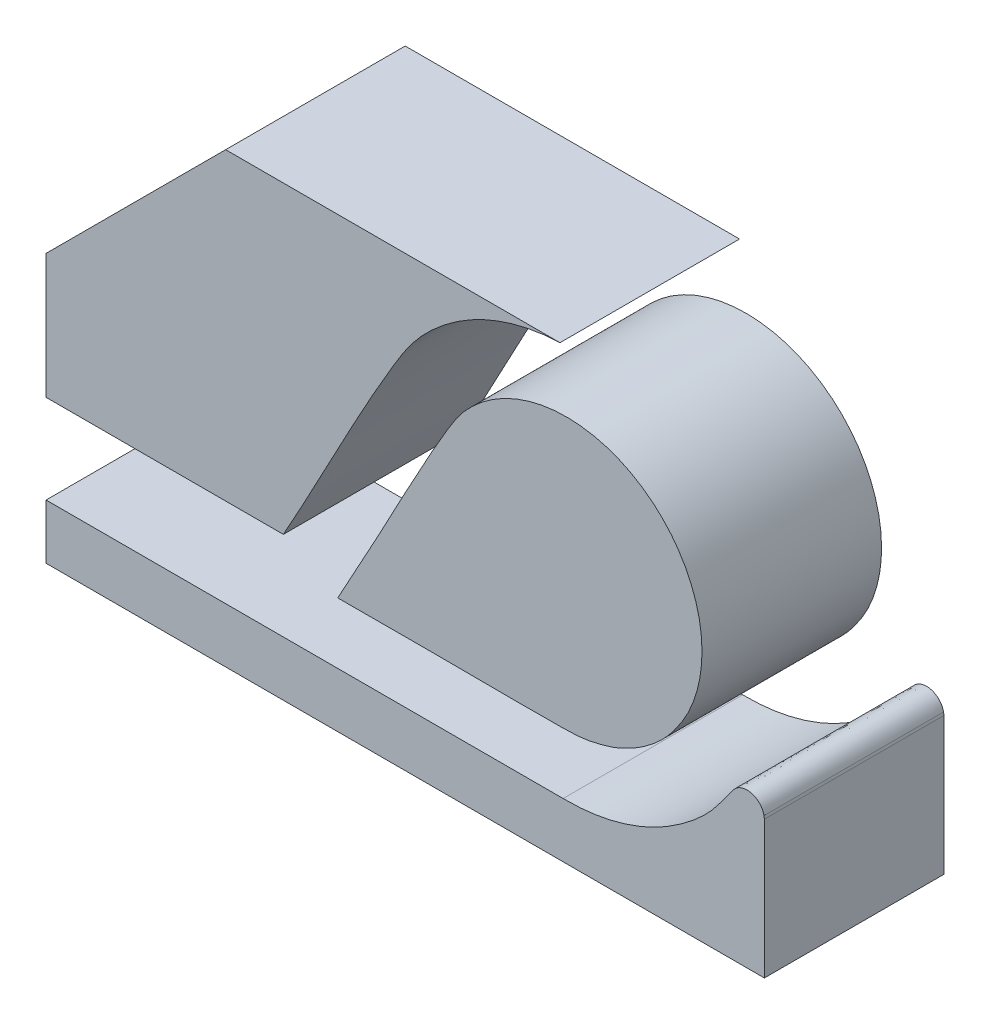
ISO-10303-21;
HEADER;
FILE_DESCRIPTION(('STEP AP214'),'2;1');
FILE_NAME('part.step','',(''),(''),'','','');
FILE_SCHEMA(('AUTOMOTIVE_DESIGN { 1 0 10303 214 1 1 1 1 }'));
ENDSEC;
DATA;
#1=APPLICATION_CONTEXT('core data for automotive mechanical design processes');
#2=APPLICATION_PROTOCOL_DEFINITION('international standard','automotive_design',2000,#1);
#3=PRODUCT_CONTEXT('',#1,'mechanical');
#4=PRODUCT('Part','Part','',(#3));
#5=PRODUCT_RELATED_PRODUCT_CATEGORY('part','',(#4));
#6=PRODUCT_DEFINITION_FORMATION('','',#4);
#7=PRODUCT_DEFINITION_CONTEXT('part definition',#1,'design');
#8=PRODUCT_DEFINITION('design','',#6,#7);
#9=PRODUCT_DEFINITION_SHAPE('','',#8);
#10=(LENGTH_UNIT() NAMED_UNIT(*) SI_UNIT(.MILLI.,.METRE.));
#11=(NAMED_UNIT(*) PLANE_ANGLE_UNIT() SI_UNIT($,.RADIAN.));
#12=(NAMED_UNIT(*) SI_UNIT($,.STERADIAN.) SOLID_ANGLE_UNIT());
#13=UNCERTAINTY_MEASURE_WITH_UNIT(LENGTH_MEASURE(1.E-05),#10,'distance_accuracy_value','');
#14=(GEOMETRIC_REPRESENTATION_CONTEXT(3) GLOBAL_UNCERTAINTY_ASSIGNED_CONTEXT((#13)) GLOBAL_UNIT_ASSIGNED_CONTEXT((#10,
#11,#12)) REPRESENTATION_CONTEXT('',''));
#15=CARTESIAN_POINT('',(0.,0.,0.));
#16=DIRECTION('',(0.,0.,1.));
#17=DIRECTION('',(1.,0.,0.));
#18=AXIS2_PLACEMENT_3D('',#15,#16,#17);
#19=CARTESIAN_POINT('',(-73.3949556313979,16.410378963894,5.));
#20=CARTESIAN_POINT('',(-73.0277419114467,17.0757318854613,5.));
#21=CARTESIAN_POINT('',(-72.0065935849801,18.925946039928,5.));
#22=CARTESIAN_POINT('',(-70.9490701940309,20.9951779777811,5.));
#23=CARTESIAN_POINT('',(-70.0234130863674,22.5185832279498,5.));
#24=CARTESIAN_POINT('',(-69.5841679400392,22.9858484151686,5.));
#25=CARTESIAN_POINT('',(-69.0781317832908,23.3766383034874,5.));
#26=CARTESIAN_POINT('',(-68.5121220467428,23.6757154495549,5.));
#27=CARTESIAN_POINT('',(-67.9042843139605,23.875664619468,5.));
#28=CARTESIAN_POINT('',(-67.2713762247597,23.9705076965152,5.));
#29=CARTESIAN_POINT('',(-66.6315595511487,23.95761371341,5.));
#30=CARTESIAN_POINT('',(-66.0030093475002,23.837333703275,5.));
#31=CARTESIAN_POINT('',(-65.4036298831868,23.6130967150452,5.));
#32=CARTESIAN_POINT('',(-64.8504774267978,23.2912869739816,5.));
#33=CARTESIAN_POINT('',(-64.3593022343778,22.8810595595448,5.));
#34=CARTESIAN_POINT('',(-63.9440844116064,22.3940973360927,5.));
#35=CARTESIAN_POINT('',(-63.6166416873118,21.8442578090215,5.));
#36=CARTESIAN_POINT('',(-63.3863080003475,21.2472022642012,5.));
#37=CARTESIAN_POINT('',(-63.2595832540932,20.6198964949968,5.));
#38=CARTESIAN_POINT('',(-63.240299322011,19.9803057131815,5.));
#39=CARTESIAN_POINT('',(-63.3281539326554,19.3462391542597,5.));
#40=CARTESIAN_POINT('',(-63.4963151713191,18.822873266533,5.));
#41=CARTESIAN_POINT('',(-63.6555595947336,18.4769507414638,5.));
#42=CARTESIAN_POINT('',(-63.8702227432938,18.110681823472,5.));
#43=CARTESIAN_POINT('',(-64.1658955906539,17.6857727130199,5.));
#44=CARTESIAN_POINT('',(-64.5888908803924,17.2904659312179,5.));
#45=CARTESIAN_POINT('',(-64.932267573991,17.0398858035983,5.));
#46=CARTESIAN_POINT('',(-65.2050822107201,16.8741184334112,5.));
#47=CARTESIAN_POINT('',(-65.4911624701182,16.733090750357,5.));
#48=CARTESIAN_POINT('',(-65.737595601697,16.6324477160917,5.));
#49=CARTESIAN_POINT('',(-65.9925806819812,16.5579282620137,5.));
#50=CARTESIAN_POINT('',(-66.1984061393678,16.5053516453406,5.));
#51=CARTESIAN_POINT('',(-66.4579346607578,16.4488192828729,5.));
#52=CARTESIAN_POINT('',(-66.7224498991614,16.4178111579424,5.));
#53=CARTESIAN_POINT('',(-67.735945429151,16.3926283074925,5.));
#54=CARTESIAN_POINT('',(-69.73973537417,16.4213086385378,5.));
#55=CARTESIAN_POINT('',(-71.7805744979587,16.4100735918947,5.));
#56=CARTESIAN_POINT('',(-73.0203742260045,16.4103473032519,5.));
#57=CARTESIAN_POINT('',(-73.1637838960396,16.410378963894,5.));
#58=B_SPLINE_CURVE_WITH_KNOTS('',3,(#19,#20,#21,#22,#23,#24,#25,#26,#27,#28,#29,#30,#31,#32,#33,
#34,#35,#36,#37,#38,#39,#40,#41,#42,#43,#44,#45,#46,#47,#48,#49,#50,#51,#52,#53,#54,#55,#56,
#57),.UNSPECIFIED.,.F.,.F.,(4,1,1,1,1,1,1,1,1,1,1,1,1,1,1,1,1,1,1,1,1,1,1,1,1,1,1,1,1,1,1,1,1,1,
1,1,4),(0.,0.080304634312455,0.223311217637975,0.24574875076157,0.268186211521939,
0.290623796229975,0.313061260343096,0.335498750343381,0.35793620920626,0.38037382737991,
0.402811343576478,0.425248837557594,0.447686333347444,0.470123867056318,0.492561383906202,
0.51499885677545,0.537436397125423,0.559873935635961,0.582311431887422,0.604748903367135,
0.62718643886649,0.640157588757618,0.644900538775652,0.672052802029292,0.694490331272225,
0.705719061569508,0.716947813367087,0.728176600015994,0.739405358547793,0.745019744338924,
0.756238516673911,0.761852913849765,0.77308165234301,0.78431043715441,0.868971771734146,
0.984843749715517,1.),.UNSPECIFIED.);
#59=DIRECTION('',(0.,0.,-1.));
#60=VECTOR('',#59,1.);
#61=SURFACE_OF_LINEAR_EXTRUSION('',#58,#60);
#62=CARTESIAN_POINT('',(-73.3949556313979,16.410378963894,0.));
#63=CARTESIAN_POINT('',(-73.0277419114467,17.0757318854613,0.));
#64=CARTESIAN_POINT('',(-72.0065935849801,18.925946039928,0.));
#65=CARTESIAN_POINT('',(-70.9490701940309,20.9951779777811,0.));
#66=CARTESIAN_POINT('',(-70.0234130863674,22.5185832279498,0.));
#67=CARTESIAN_POINT('',(-69.5841679400392,22.9858484151686,0.));
#68=CARTESIAN_POINT('',(-69.0781317832908,23.3766383034874,0.));
#69=CARTESIAN_POINT('',(-68.5121220467428,23.6757154495549,0.));
#70=CARTESIAN_POINT('',(-67.9042843139605,23.875664619468,0.));
#71=CARTESIAN_POINT('',(-67.2713762247597,23.9705076965152,0.));
#72=CARTESIAN_POINT('',(-66.6315595511487,23.95761371341,0.));
#73=CARTESIAN_POINT('',(-66.0030093475002,23.837333703275,0.));
#74=CARTESIAN_POINT('',(-65.4036298831868,23.6130967150452,0.));
#75=CARTESIAN_POINT('',(-64.8504774267978,23.2912869739816,0.));
#76=CARTESIAN_POINT('',(-64.3593022343778,22.8810595595448,0.));
#77=CARTESIAN_POINT('',(-63.9440844116064,22.3940973360927,0.));
#78=CARTESIAN_POINT('',(-63.6166416873118,21.8442578090215,0.));
#79=CARTESIAN_POINT('',(-63.3863080003475,21.2472022642012,0.));
#80=CARTESIAN_POINT('',(-63.2595832540932,20.6198964949968,0.));
#81=CARTESIAN_POINT('',(-63.240299322011,19.9803057131815,0.));
#82=CARTESIAN_POINT('',(-63.3281539326554,19.3462391542597,0.));
#83=CARTESIAN_POINT('',(-63.4963151713191,18.822873266533,0.));
#84=CARTESIAN_POINT('',(-63.6555595947336,18.4769507414638,0.));
#85=CARTESIAN_POINT('',(-63.8702227432938,18.110681823472,0.));
#86=CARTESIAN_POINT('',(-64.1658955906539,17.6857727130199,0.));
#87=CARTESIAN_POINT('',(-64.5888908803924,17.2904659312179,0.));
#88=CARTESIAN_POINT('',(-64.932267573991,17.0398858035983,0.));
#89=CARTESIAN_POINT('',(-65.2050822107201,16.8741184334112,0.));
#90=CARTESIAN_POINT('',(-65.4911624701182,16.733090750357,0.));
#91=CARTESIAN_POINT('',(-65.737595601697,16.6324477160917,0.));
#92=CARTESIAN_POINT('',(-65.9925806819812,16.5579282620137,0.));
#93=CARTESIAN_POINT('',(-66.1984061393678,16.5053516453406,0.));
#94=CARTESIAN_POINT('',(-66.4579346607578,16.4488192828729,0.));
#95=CARTESIAN_POINT('',(-66.7224498991614,16.4178111579424,0.));
#96=CARTESIAN_POINT('',(-67.735945429151,16.3926283074925,0.));
#97=CARTESIAN_POINT('',(-69.73973537417,16.4213086385378,0.));
#98=CARTESIAN_POINT('',(-71.7805744979587,16.4100735918947,0.));
#99=CARTESIAN_POINT('',(-73.0203742260045,16.4103473032519,0.));
#100=CARTESIAN_POINT('',(-73.1637838960396,16.410378963894,0.));
#101=B_SPLINE_CURVE_WITH_KNOTS('',3,(#62,#63,#64,#65,#66,#67,#68,#69,#70,#71,#72,#73,#74,#75,
#76,#77,#78,#79,#80,#81,#82,#83,#84,#85,#86,#87,#88,#89,#90,#91,#92,#93,#94,#95,#96,#97,#98,#99,
#100),.UNSPECIFIED.,.F.,.F.,(4,1,1,1,1,1,1,1,1,1,1,1,1,1,1,1,1,1,1,1,1,1,1,1,1,1,1,1,1,1,1,1,1,
1,1,1,4),(0.,0.080304634312455,0.223311217637975,0.24574875076157,0.268186211521939,
0.290623796229975,0.313061260343096,0.335498750343381,0.35793620920626,0.38037382737991,
0.402811343576478,0.425248837557594,0.447686333347444,0.470123867056318,0.492561383906202,
0.51499885677545,0.537436397125423,0.559873935635961,0.582311431887422,0.604748903367135,
0.62718643886649,0.640157588757618,0.644900538775652,0.672052802029292,0.694490331272225,
0.705719061569508,0.716947813367087,0.728176600015994,0.739405358547793,0.745019744338924,
0.756238516673911,0.761852913849765,0.77308165234301,0.78431043715441,0.868971771734146,
0.984843749715517,1.),.UNSPECIFIED.);
#102=CARTESIAN_POINT('',(-73.3949556313979,16.410378963894,0.));
#103=VERTEX_POINT('',#102);
#104=CARTESIAN_POINT('',(-73.1637838960396,16.410378963894,0.));
#105=VERTEX_POINT('',#104);
#106=EDGE_CURVE('E183',#103,#105,#101,.T.);
#107=ORIENTED_EDGE('',*,*,#106,.F.);
#108=DIRECTION('',(0.,0.,-1.));
#109=VECTOR('',#108,1.);
#110=CARTESIAN_POINT('',(-73.3949556313979,16.410378963894,5.));
#111=LINE('',#110,#109);
#112=CARTESIAN_POINT('',(-73.3949556313979,16.410378963894,5.));
#113=VERTEX_POINT('',#112);
#114=EDGE_CURVE('E13',#113,#103,#111,.T.);
#115=ORIENTED_EDGE('',*,*,#114,.F.);
#116=CARTESIAN_POINT('',(-73.1637838960396,16.410378963894,5.));
#117=VERTEX_POINT('',#116);
#118=EDGE_CURVE('E184',#113,#117,#58,.T.);
#119=ORIENTED_EDGE('',*,*,#118,.T.);
#120=DIRECTION('',(0.,0.,-1.));
#121=VECTOR('',#120,1.);
#122=CARTESIAN_POINT('',(-73.1637838960396,16.410378963894,5.));
#123=LINE('',#122,#121);
#124=EDGE_CURVE('E163',#117,#105,#123,.T.);
#125=ORIENTED_EDGE('',*,*,#124,.T.);
#126=EDGE_LOOP('',(#107,#115,#119,#125));
#127=FACE_BOUND('',#126,.T.);
#128=ADVANCED_FACE('F154',(#127),#61,.T.);
#129=CARTESIAN_POINT('',(0.,16.410378963894,5.));
#130=DIRECTION('',(0.,1.,0.));
#131=DIRECTION('',(0.,0.,1.));
#132=AXIS2_PLACEMENT_3D('',#129,#130,#131);
#133=PLANE('',#132);
#134=DIRECTION('',(1.,0.,0.));
#135=VECTOR('',#134,1.);
#136=CARTESIAN_POINT('',(0.,16.410378963894,0.));
#137=LINE('',#136,#135);
#138=EDGE_CURVE('E185',#103,#105,#137,.T.);
#139=ORIENTED_EDGE('',*,*,#138,.T.);
#140=ORIENTED_EDGE('',*,*,#124,.F.);
#141=DIRECTION('',(1.,0.,0.));
#142=VECTOR('',#141,1.);
#143=CARTESIAN_POINT('',(0.,16.410378963894,5.));
#144=LINE('',#143,#142);
#145=EDGE_CURVE('E170',#113,#117,#144,.T.);
#146=ORIENTED_EDGE('',*,*,#145,.F.);
#147=ORIENTED_EDGE('',*,*,#114,.T.);
#148=EDGE_LOOP('',(#139,#140,#146,#147));
#149=FACE_BOUND('',#148,.T.);
#150=ADVANCED_FACE('F186',(#149),#133,.F.);
#151=CARTESIAN_POINT('',(0.,0.,5.));
#152=DIRECTION('',(0.,0.,1.));
#153=DIRECTION('',(1.,0.,0.));
#154=AXIS2_PLACEMENT_3D('',#151,#152,#153);
#155=PLANE('',#154);
#156=ORIENTED_EDGE('',*,*,#118,.F.);
#157=ORIENTED_EDGE('',*,*,#145,.T.);
#158=EDGE_LOOP('',(#156,#157));
#159=FACE_BOUND('',#158,.T.);
#160=ADVANCED_FACE('F204',(#159),#155,.T.);
#161=CARTESIAN_POINT('',(0.,0.,0.));
#162=DIRECTION('',(0.,0.,1.));
#163=DIRECTION('',(1.,0.,0.));
#164=AXIS2_PLACEMENT_3D('',#161,#162,#163);
#165=PLANE('',#164);
#166=ORIENTED_EDGE('',*,*,#106,.T.);
#167=ORIENTED_EDGE('',*,*,#138,.F.);
#168=EDGE_LOOP('',(#166,#167));
#169=FACE_BOUND('',#168,.T.);
#170=ADVANCED_FACE('F189',(#169),#165,.F.);
#171=CLOSED_SHELL('',(#128,#150,#160,#170));
#172=MANIFOLD_SOLID_BREP('B2',#171);
#173=CARTESIAN_POINT('',(-67.1197841588077,14.7103781264487,5.));
#174=CARTESIAN_POINT('',(-67.0935582727583,14.7102319716835,5.));
#175=CARTESIAN_POINT('',(-66.7570566974385,14.7101815464652,5.));
#176=CARTESIAN_POINT('',(-66.1180095334015,14.7588945634733,5.));
#177=CARTESIAN_POINT('',(-65.2199205015816,14.9903824771147,5.));
#178=CARTESIAN_POINT('',(-64.5108099227769,15.3040428583451,5.));
#179=CARTESIAN_POINT('',(-63.991676041918,15.6249691899164,5.));
#180=CARTESIAN_POINT('',(-63.4872165289154,15.9880850617171,5.));
#181=CARTESIAN_POINT('',(-62.9165327240656,16.510148843801,5.));
#182=CARTESIAN_POINT('',(-62.565024786149,17.0505172792495,5.));
#183=CARTESIAN_POINT('',(-62.3423326323971,17.3353490876502,5.));
#184=CARTESIAN_POINT('',(-62.2809848936338,17.3871351316683,5.));
#185=CARTESIAN_POINT('',(-62.2125810070607,17.4286842174469,5.));
#186=CARTESIAN_POINT('',(-62.1380837345273,17.4582133037352,5.));
#187=CARTESIAN_POINT('',(-62.0597834049141,17.4750950936617,5.));
#188=CARTESIAN_POINT('',(-61.9797578865785,17.478809868195,5.));
#189=CARTESIAN_POINT('',(-61.9002192850942,17.46927582821,5.));
#190=CARTESIAN_POINT('',(-61.8233449156038,17.4467446622618,5.));
#191=CARTESIAN_POINT('',(-61.7512341408782,17.4118465196535,5.));
#192=CARTESIAN_POINT('',(-61.6858896229193,17.3655180457804,5.));
#193=CARTESIAN_POINT('',(-61.629025833112,17.309058933585,5.));
#194=CARTESIAN_POINT('',(-61.5824618727563,17.2439501751695,5.));
#195=CARTESIAN_POINT('',(-61.5465173340048,17.1721997553296,5.));
#196=CARTESIAN_POINT('',(-61.5326713839836,17.1206976809159,5.));
#197=CARTESIAN_POINT('',(-61.5261509381759,17.094897330946,5.));
#198=B_SPLINE_CURVE_WITH_KNOTS('',3,(#173,#174,#175,#176,#177,#178,#179,#180,#181,#182,#183,
#184,#185,#186,#187,#188,#189,#190,#191,#192,#193,#194,#195,#196,#197),.UNSPECIFIED.,.F.,.F.,(4,
1,1,1,1,1,1,1,1,1,1,1,1,1,1,1,1,1,1,1,1,1,4),(0.429055887917548,0.433439487481544,
0.485344665051265,0.537249839379783,0.589155040979122,0.615107635909553,0.641060230839985,
0.692965395798068,0.74487056703484,0.749356681655219,0.753842781267947,0.758328884056481,
0.762814933799586,0.767301114348765,0.771787169091217,0.776273249376151,0.780759381539864,
0.785245497393847,0.789731590473831,0.794217734069126,0.798703798762529,0.803189924813312,
0.807676026001087),.UNSPECIFIED.);
#199=DIRECTION('',(0.,0.,-1.));
#200=VECTOR('',#199,1.);
#201=SURFACE_OF_LINEAR_EXTRUSION('',#198,#200);
#202=CARTESIAN_POINT('',(-67.1197841588077,14.7103781264487,0.));
#203=CARTESIAN_POINT('',(-67.0935582727583,14.7102319716835,0.));
#204=CARTESIAN_POINT('',(-66.7570566974385,14.7101815464652,0.));
#205=CARTESIAN_POINT('',(-66.1180095334015,14.7588945634733,0.));
#206=CARTESIAN_POINT('',(-65.2199205015816,14.9903824771147,0.));
#207=CARTESIAN_POINT('',(-64.5108099227769,15.3040428583451,0.));
#208=CARTESIAN_POINT('',(-63.991676041918,15.6249691899164,0.));
#209=CARTESIAN_POINT('',(-63.4872165289154,15.9880850617171,0.));
#210=CARTESIAN_POINT('',(-62.9165327240656,16.510148843801,0.));
#211=CARTESIAN_POINT('',(-62.565024786149,17.0505172792495,0.));
#212=CARTESIAN_POINT('',(-62.3423326323971,17.3353490876502,0.));
#213=CARTESIAN_POINT('',(-62.2809848936338,17.3871351316683,0.));
#214=CARTESIAN_POINT('',(-62.2125810070607,17.4286842174469,0.));
#215=CARTESIAN_POINT('',(-62.1380837345273,17.4582133037352,0.));
#216=CARTESIAN_POINT('',(-62.0597834049141,17.4750950936617,0.));
#217=CARTESIAN_POINT('',(-61.9797578865785,17.478809868195,0.));
#218=CARTESIAN_POINT('',(-61.9002192850942,17.46927582821,0.));
#219=CARTESIAN_POINT('',(-61.8233449156038,17.4467446622618,0.));
#220=CARTESIAN_POINT('',(-61.7512341408782,17.4118465196535,0.));
#221=CARTESIAN_POINT('',(-61.6858896229193,17.3655180457804,0.));
#222=CARTESIAN_POINT('',(-61.629025833112,17.309058933585,0.));
#223=CARTESIAN_POINT('',(-61.5824618727563,17.2439501751695,0.));
#224=CARTESIAN_POINT('',(-61.5465173340048,17.1721997553296,0.));
#225=CARTESIAN_POINT('',(-61.5326713839836,17.1206976809159,0.));
#226=CARTESIAN_POINT('',(-61.5261509381759,17.094897330946,0.));
#227=B_SPLINE_CURVE_WITH_KNOTS('',3,(#202,#203,#204,#205,#206,#207,#208,#209,#210,#211,#212,
#213,#214,#215,#216,#217,#218,#219,#220,#221,#222,#223,#224,#225,#226),.UNSPECIFIED.,.F.,.F.,(4,
1,1,1,1,1,1,1,1,1,1,1,1,1,1,1,1,1,1,1,1,1,4),(0.429055887917548,0.433439487481544,
0.485344665051265,0.537249839379783,0.589155040979122,0.615107635909553,0.641060230839985,
0.692965395798068,0.74487056703484,0.749356681655219,0.753842781267947,0.758328884056481,
0.762814933799586,0.767301114348765,0.771787169091217,0.776273249376151,0.780759381539864,
0.785245497393847,0.789731590473831,0.794217734069126,0.798703798762529,0.803189924813312,
0.807676026001087),.UNSPECIFIED.);
#228=CARTESIAN_POINT('',(-67.1197841588077,14.7103781264487,0.));
#229=VERTEX_POINT('',#228);
#230=CARTESIAN_POINT('',(-61.5261509381759,17.094897330946,0.));
#231=VERTEX_POINT('',#230);
#232=EDGE_CURVE('E329',#229,#231,#227,.T.);
#233=ORIENTED_EDGE('',*,*,#232,.F.);
#234=DIRECTION('',(0.,0.,-1.));
#235=VECTOR('',#234,1.);
#236=CARTESIAN_POINT('',(-67.1197841588077,14.7103781264487,5.));
#237=LINE('',#236,#235);
#238=CARTESIAN_POINT('',(-67.1197841588077,14.7103781264487,5.));
#239=VERTEX_POINT('',#238);
#240=EDGE_CURVE('E152',#239,#229,#237,.T.);
#241=ORIENTED_EDGE('',*,*,#240,.F.);
#242=CARTESIAN_POINT('',(-61.5261509381759,17.094897330946,5.));
#243=VERTEX_POINT('',#242);
#244=EDGE_CURVE('E347',#239,#243,#198,.T.);
#245=ORIENTED_EDGE('',*,*,#244,.T.);
#246=DIRECTION('',(0.,0.,-1.));
#247=VECTOR('',#246,1.);
#248=CARTESIAN_POINT('',(-61.5261509381759,17.094897330946,5.));
#249=LINE('',#248,#247);
#250=EDGE_CURVE('E263',#243,#231,#249,.T.);
#251=ORIENTED_EDGE('',*,*,#250,.T.);
#252=EDGE_LOOP('',(#233,#241,#245,#251));
#253=FACE_BOUND('',#252,.T.);
#254=ADVANCED_FACE('F246',(#253),#201,.T.);
#255=CARTESIAN_POINT('',(0.,14.7103781264487,5.));
#256=DIRECTION('',(0.,1.,0.));
#257=DIRECTION('',(0.,0.,1.));
#258=AXIS2_PLACEMENT_3D('',#255,#256,#257);
#259=PLANE('',#258);
#260=DIRECTION('',(1.,0.,0.));
#261=VECTOR('',#260,1.);
#262=CARTESIAN_POINT('',(0.,14.7103781264487,0.));
#263=LINE('',#262,#261);
#264=CARTESIAN_POINT('',(-81.5161704384314,14.7103781264487,0.));
#265=VERTEX_POINT('',#264);
#266=EDGE_CURVE('E333',#265,#229,#263,.T.);
#267=ORIENTED_EDGE('',*,*,#266,.F.);
#268=DIRECTION('',(0.,0.,-1.));
#269=VECTOR('',#268,1.);
#270=CARTESIAN_POINT('',(-81.5161704384314,14.7103781264487,5.));
#271=LINE('',#270,#269);
#272=CARTESIAN_POINT('',(-81.5161704384314,14.7103781264487,5.));
#273=VERTEX_POINT('',#272);
#274=EDGE_CURVE('E255',#273,#265,#271,.T.);
#275=ORIENTED_EDGE('',*,*,#274,.F.);
#276=DIRECTION('',(1.,0.,0.));
#277=VECTOR('',#276,1.);
#278=CARTESIAN_POINT('',(0.,14.7103781264487,5.));
#279=LINE('',#278,#277);
#280=EDGE_CURVE('E359',#273,#239,#279,.T.);
#281=ORIENTED_EDGE('',*,*,#280,.T.);
#282=ORIENTED_EDGE('',*,*,#240,.T.);
#283=EDGE_LOOP('',(#267,#275,#281,#282));
#284=FACE_BOUND('',#283,.T.);
#285=ADVANCED_FACE('F358',(#284),#259,.T.);
#286=CARTESIAN_POINT('',(-81.5161704384314,0.,5.));
#287=DIRECTION('',(1.,0.,0.));
#288=DIRECTION('',(0.,0.,-1.));
#289=AXIS2_PLACEMENT_3D('',#286,#287,#288);
#290=PLANE('',#289);
#291=DIRECTION('',(0.,-1.,0.));
#292=VECTOR('',#291,1.);
#293=CARTESIAN_POINT('',(-81.5161704384314,0.,0.));
#294=LINE('',#293,#292);
#295=CARTESIAN_POINT('',(-81.5161704384314,13.1842514883938,0.));
#296=VERTEX_POINT('',#295);
#297=EDGE_CURVE('E339',#265,#296,#294,.T.);
#298=ORIENTED_EDGE('',*,*,#297,.T.);
#299=DIRECTION('',(0.,0.,-1.));
#300=VECTOR('',#299,1.);
#301=CARTESIAN_POINT('',(-81.5161704384314,13.1842514883938,5.));
#302=LINE('',#301,#300);
#303=CARTESIAN_POINT('',(-81.5161704384314,13.1842514883938,5.));
#304=VERTEX_POINT('',#303);
#305=EDGE_CURVE('E321',#304,#296,#302,.T.);
#306=ORIENTED_EDGE('',*,*,#305,.F.);
#307=DIRECTION('',(0.,-1.,0.));
#308=VECTOR('',#307,1.);
#309=CARTESIAN_POINT('',(-81.5161704384314,0.,5.));
#310=LINE('',#309,#308);
#311=EDGE_CURVE('E309',#273,#304,#310,.T.);
#312=ORIENTED_EDGE('',*,*,#311,.F.);
#313=ORIENTED_EDGE('',*,*,#274,.T.);
#314=EDGE_LOOP('',(#298,#306,#312,#313));
#315=FACE_BOUND('',#314,.T.);
#316=ADVANCED_FACE('F352',(#315),#290,.F.);
#317=CARTESIAN_POINT('',(0.,13.1842514883938,5.));
#318=DIRECTION('',(0.,1.,0.));
#319=DIRECTION('',(0.,0.,1.));
#320=AXIS2_PLACEMENT_3D('',#317,#318,#319);
#321=PLANE('',#320);
#322=DIRECTION('',(1.,0.,0.));
#323=VECTOR('',#322,1.);
#324=CARTESIAN_POINT('',(0.,13.1842514883938,0.));
#325=LINE('',#324,#323);
#326=CARTESIAN_POINT('',(-61.5161708854663,13.1842514883938,0.));
#327=VERTEX_POINT('',#326);
#328=EDGE_CURVE('E318',#296,#327,#325,.T.);
#329=ORIENTED_EDGE('',*,*,#328,.T.);
#330=DIRECTION('',(0.,0.,-1.));
#331=VECTOR('',#330,1.);
#332=CARTESIAN_POINT('',(-61.5161708854663,13.1842514883938,5.));
#333=LINE('',#332,#331);
#334=CARTESIAN_POINT('',(-61.5161708854663,13.1842514883938,5.));
#335=VERTEX_POINT('',#334);
#336=EDGE_CURVE('E315',#335,#327,#333,.T.);
#337=ORIENTED_EDGE('',*,*,#336,.F.);
#338=DIRECTION('',(1.,0.,0.));
#339=VECTOR('',#338,1.);
#340=CARTESIAN_POINT('',(0.,13.1842514883938,5.));
#341=LINE('',#340,#339);
#342=EDGE_CURVE('E301',#304,#335,#341,.T.);
#343=ORIENTED_EDGE('',*,*,#342,.F.);
#344=ORIENTED_EDGE('',*,*,#305,.T.);
#345=EDGE_LOOP('',(#329,#337,#343,#344));
#346=FACE_BOUND('',#345,.T.);
#347=ADVANCED_FACE('F316',(#346),#321,.F.);
#348=CARTESIAN_POINT('',(-61.5161708854663,0.,5.));
#349=DIRECTION('',(1.,0.,0.));
#350=DIRECTION('',(0.,0.,-1.));
#351=AXIS2_PLACEMENT_3D('',#348,#349,#350);
#352=PLANE('',#351);
#353=DIRECTION('',(0.,-1.,0.));
#354=VECTOR('',#353,1.);
#355=CARTESIAN_POINT('',(-61.5161708854663,0.,0.));
#356=LINE('',#355,#354);
#357=CARTESIAN_POINT('',(-61.5161708854663,17.0157814782324,0.));
#358=VERTEX_POINT('',#357);
#359=EDGE_CURVE('E342',#358,#327,#356,.T.);
#360=ORIENTED_EDGE('',*,*,#359,.F.);
#361=DIRECTION('',(0.,0.,-1.));
#362=VECTOR('',#361,1.);
#363=CARTESIAN_POINT('',(-61.5161708854663,17.0157814782324,5.));
#364=LINE('',#363,#362);
#365=CARTESIAN_POINT('',(-61.5161708854663,17.0157814782324,5.));
#366=VERTEX_POINT('',#365);
#367=EDGE_CURVE('E282',#366,#358,#364,.T.);
#368=ORIENTED_EDGE('',*,*,#367,.F.);
#369=DIRECTION('',(0.,-1.,0.));
#370=VECTOR('',#369,1.);
#371=CARTESIAN_POINT('',(-61.5161708854663,0.,5.));
#372=LINE('',#371,#370);
#373=EDGE_CURVE('E306',#366,#335,#372,.T.);
#374=ORIENTED_EDGE('',*,*,#373,.T.);
#375=ORIENTED_EDGE('',*,*,#336,.T.);
#376=EDGE_LOOP('',(#360,#368,#374,#375));
#377=FACE_BOUND('',#376,.T.);
#378=ADVANCED_FACE('F323',(#377),#352,.T.);
#379=CARTESIAN_POINT('',(-58.4397949632966,-7.37187572485799,5.));
#380=DIRECTION('',(0.992137456982468,0.125152972207465,0.));
#381=DIRECTION('',(-0.125152972207465,0.992137456982468,0.));
#382=AXIS2_PLACEMENT_3D('',#379,#380,#381);
#383=PLANE('',#382);
#384=DIRECTION('',(0.125152972207465,-0.992137456982468,0.));
#385=VECTOR('',#384,1.);
#386=CARTESIAN_POINT('',(-58.4397949632966,-7.37187572485799,0.));
#387=LINE('',#386,#385);
#388=EDGE_CURVE('E344',#231,#358,#387,.T.);
#389=ORIENTED_EDGE('',*,*,#388,.F.);
#390=ORIENTED_EDGE('',*,*,#250,.F.);
#391=DIRECTION('',(0.125152972207465,-0.992137456982468,0.));
#392=VECTOR('',#391,1.);
#393=CARTESIAN_POINT('',(-58.4397949632966,-7.37187572485799,5.));
#394=LINE('',#393,#392);
#395=EDGE_CURVE('E324',#243,#366,#394,.T.);
#396=ORIENTED_EDGE('',*,*,#395,.T.);
#397=ORIENTED_EDGE('',*,*,#367,.T.);
#398=EDGE_LOOP('',(#389,#390,#396,#397));
#399=FACE_BOUND('',#398,.T.);
#400=ADVANCED_FACE('F360',(#399),#383,.T.);
#401=CARTESIAN_POINT('',(0.,0.,5.));
#402=DIRECTION('',(0.,0.,1.));
#403=DIRECTION('',(1.,0.,0.));
#404=AXIS2_PLACEMENT_3D('',#401,#402,#403);
#405=PLANE('',#404);
#406=ORIENTED_EDGE('',*,*,#244,.F.);
#407=ORIENTED_EDGE('',*,*,#280,.F.);
#408=ORIENTED_EDGE('',*,*,#311,.T.);
#409=ORIENTED_EDGE('',*,*,#342,.T.);
#410=ORIENTED_EDGE('',*,*,#373,.F.);
#411=ORIENTED_EDGE('',*,*,#395,.F.);
#412=EDGE_LOOP('',(#406,#407,#408,#409,#410,#411));
#413=FACE_BOUND('',#412,.T.);
#414=ADVANCED_FACE('F303',(#413),#405,.T.);
#415=CARTESIAN_POINT('',(0.,0.,0.));
#416=DIRECTION('',(0.,0.,1.));
#417=DIRECTION('',(1.,0.,0.));
#418=AXIS2_PLACEMENT_3D('',#415,#416,#417);
#419=PLANE('',#418);
#420=ORIENTED_EDGE('',*,*,#232,.T.);
#421=ORIENTED_EDGE('',*,*,#388,.T.);
#422=ORIENTED_EDGE('',*,*,#359,.T.);
#423=ORIENTED_EDGE('',*,*,#328,.F.);
#424=ORIENTED_EDGE('',*,*,#297,.F.);
#425=ORIENTED_EDGE('',*,*,#266,.T.);
#426=EDGE_LOOP('',(#420,#421,#422,#423,#424,#425));
#427=FACE_BOUND('',#426,.T.);
#428=ADVANCED_FACE('F357',(#427),#419,.F.);
#429=CLOSED_SHELL('',(#254,#285,#316,#347,#378,#400,#414,#428));
#430=MANIFOLD_SOLID_BREP('B7',#429);
#431=CARTESIAN_POINT('',(-67.2070323788154,25.6578645121518,5.));
#432=CARTESIAN_POINT('',(-67.8412912053085,25.637703186318,5.));
#433=CARTESIAN_POINT('',(-68.7860073071451,25.4383981355366,5.));
#434=CARTESIAN_POINT('',(-69.9236105502349,24.8650034486674,5.));
#435=CARTESIAN_POINT('',(-70.6872021431707,24.2927479892754,5.));
#436=CARTESIAN_POINT('',(-71.3493902586507,23.6015798798765,5.));
#437=CARTESIAN_POINT('',(-72.7993065853915,21.2411318156756,5.));
#438=CARTESIAN_POINT('',(-73.8673201832514,19.042669196316,5.));
#439=CARTESIAN_POINT('',(-74.9087366574037,17.1853771817151,5.));
#440=B_SPLINE_CURVE_WITH_KNOTS('',3,(#431,#432,#433,#434,#435,#436,#437,#438,#439),
.UNSPECIFIED.,.F.,.F.,(4,1,1,1,1,1,4),(0.,0.15724275116631,0.235864252030199,0.314485504743171,
0.393106930758547,0.471729270501608,1.),.UNSPECIFIED.);
#441=DIRECTION('',(0.,0.,-1.));
#442=VECTOR('',#441,1.);
#443=SURFACE_OF_LINEAR_EXTRUSION('',#440,#442);
#444=CARTESIAN_POINT('',(-67.2070323788154,25.6578645121518,0.));
#445=CARTESIAN_POINT('',(-67.8412912053085,25.637703186318,0.));
#446=CARTESIAN_POINT('',(-68.7860073071451,25.4383981355366,0.));
#447=CARTESIAN_POINT('',(-69.9236105502349,24.8650034486674,0.));
#448=CARTESIAN_POINT('',(-70.6872021431707,24.2927479892754,0.));
#449=CARTESIAN_POINT('',(-71.3493902586507,23.6015798798765,0.));
#450=CARTESIAN_POINT('',(-72.7993065853915,21.2411318156756,0.));
#451=CARTESIAN_POINT('',(-73.8673201832514,19.042669196316,0.));
#452=CARTESIAN_POINT('',(-74.9087366574037,17.1853771817151,0.));
#453=B_SPLINE_CURVE_WITH_KNOTS('',3,(#444,#445,#446,#447,#448,#449,#450,#451,#452),
.UNSPECIFIED.,.F.,.F.,(4,1,1,1,1,1,4),(0.,0.15724275116631,0.235864252030199,0.314485504743171,
0.393106930758547,0.471729270501608,1.),.UNSPECIFIED.);
#454=CARTESIAN_POINT('',(-67.2070323788154,25.6578645121518,0.));
#455=VERTEX_POINT('',#454);
#456=CARTESIAN_POINT('',(-74.9087366574037,17.1853771817151,0.));
#457=VERTEX_POINT('',#456);
#458=EDGE_CURVE('E510',#455,#457,#453,.T.);
#459=ORIENTED_EDGE('',*,*,#458,.F.);
#460=DIRECTION('',(0.,0.,-1.));
#461=VECTOR('',#460,1.);
#462=CARTESIAN_POINT('',(-67.2070323788154,25.6578645121518,5.));
#463=LINE('',#462,#461);
#464=CARTESIAN_POINT('',(-67.2070323788154,25.6578645121518,5.));
#465=VERTEX_POINT('',#464);
#466=EDGE_CURVE('E244',#465,#455,#463,.T.);
#467=ORIENTED_EDGE('',*,*,#466,.F.);
#468=CARTESIAN_POINT('',(-74.9087366574037,17.1853771817151,5.));
#469=VERTEX_POINT('',#468);
#470=EDGE_CURVE('E524',#465,#469,#440,.T.);
#471=ORIENTED_EDGE('',*,*,#470,.T.);
#472=DIRECTION('',(0.,0.,-1.));
#473=VECTOR('',#472,1.);
#474=CARTESIAN_POINT('',(-74.9087366574037,17.1853771817151,5.));
#475=LINE('',#474,#473);
#476=EDGE_CURVE('E479',#469,#457,#475,.T.);
#477=ORIENTED_EDGE('',*,*,#476,.T.);
#478=EDGE_LOOP('',(#459,#467,#471,#477));
#479=FACE_BOUND('',#478,.T.);
#480=ADVANCED_FACE('F436',(#479),#443,.T.);
#481=CARTESIAN_POINT('',(0.,25.6578645121518,5.));
#482=DIRECTION('',(0.,-1.,0.));
#483=DIRECTION('',(0.,0.,-1.));
#484=AXIS2_PLACEMENT_3D('',#481,#482,#483);
#485=PLANE('',#484);
#486=DIRECTION('',(-1.,0.,0.));
#487=VECTOR('',#486,1.);
#488=CARTESIAN_POINT('',(0.,25.6578645121518,0.));
#489=LINE('',#488,#487);
#490=CARTESIAN_POINT('',(-76.5161705501901,25.6578645121518,0.));
#491=VERTEX_POINT('',#490);
#492=EDGE_CURVE('E515',#455,#491,#489,.T.);
#493=ORIENTED_EDGE('',*,*,#492,.T.);
#494=DIRECTION('',(0.,0.,-1.));
#495=VECTOR('',#494,1.);
#496=CARTESIAN_POINT('',(-76.5161705501901,25.6578645121518,5.));
#497=LINE('',#496,#495);
#498=CARTESIAN_POINT('',(-76.5161705501901,25.6578645121518,5.));
#499=VERTEX_POINT('',#498);
#500=EDGE_CURVE('E445',#499,#491,#497,.T.);
#501=ORIENTED_EDGE('',*,*,#500,.F.);
#502=DIRECTION('',(-1.,0.,0.));
#503=VECTOR('',#502,1.);
#504=CARTESIAN_POINT('',(0.,25.6578645121518,5.));
#505=LINE('',#504,#503);
#506=EDGE_CURVE('E494',#465,#499,#505,.T.);
#507=ORIENTED_EDGE('',*,*,#506,.F.);
#508=ORIENTED_EDGE('',*,*,#466,.T.);
#509=EDGE_LOOP('',(#493,#501,#507,#508));
#510=FACE_BOUND('',#509,.T.);
#511=ADVANCED_FACE('F540',(#510),#485,.F.);
#512=CARTESIAN_POINT('',(-51.0870104050459,51.0870199207455,5.));
#513=DIRECTION('',(0.707106715332083,-0.707106847041006,0.));
#514=DIRECTION('',(0.707106847041006,0.707106715332083,0.));
#515=AXIS2_PLACEMENT_3D('',#512,#513,#514);
#516=PLANE('',#515);
#517=DIRECTION('',(-0.707106847041006,-0.707106715332083,0.));
#518=VECTOR('',#517,1.);
#519=CARTESIAN_POINT('',(-51.0870104050459,51.0870199207455,0.));
#520=LINE('',#519,#518);
#521=CARTESIAN_POINT('',(-81.5161704384314,20.6578655552331,0.));
#522=VERTEX_POINT('',#521);
#523=EDGE_CURVE('E502',#491,#522,#520,.T.);
#524=ORIENTED_EDGE('',*,*,#523,.T.);
#525=DIRECTION('',(0.,0.,-1.));
#526=VECTOR('',#525,1.);
#527=CARTESIAN_POINT('',(-81.5161704384314,20.6578655552331,5.));
#528=LINE('',#527,#526);
#529=CARTESIAN_POINT('',(-81.5161704384314,20.6578655552331,5.));
#530=VERTEX_POINT('',#529);
#531=EDGE_CURVE('E499',#530,#522,#528,.T.);
#532=ORIENTED_EDGE('',*,*,#531,.F.);
#533=DIRECTION('',(-0.707106847041006,-0.707106715332083,0.));
#534=VECTOR('',#533,1.);
#535=CARTESIAN_POINT('',(-51.0870104050459,51.0870199207455,5.));
#536=LINE('',#535,#534);
#537=EDGE_CURVE('E489',#499,#530,#536,.T.);
#538=ORIENTED_EDGE('',*,*,#537,.F.);
#539=ORIENTED_EDGE('',*,*,#500,.T.);
#540=EDGE_LOOP('',(#524,#532,#538,#539));
#541=FACE_BOUND('',#540,.T.);
#542=ADVANCED_FACE('F500',(#541),#516,.F.);
#543=CARTESIAN_POINT('',(-81.5161704384314,0.,5.));
#544=DIRECTION('',(1.,0.,0.));
#545=DIRECTION('',(0.,0.,-1.));
#546=AXIS2_PLACEMENT_3D('',#543,#544,#545);
#547=PLANE('',#546);
#548=DIRECTION('',(0.,-1.,0.));
#549=VECTOR('',#548,1.);
#550=CARTESIAN_POINT('',(-81.5161704384314,0.,0.));
#551=LINE('',#550,#549);
#552=CARTESIAN_POINT('',(-81.5161704384314,17.1853771817151,0.));
#553=VERTEX_POINT('',#552);
#554=EDGE_CURVE('E472',#522,#553,#551,.T.);
#555=ORIENTED_EDGE('',*,*,#554,.T.);
#556=DIRECTION('',(0.,0.,-1.));
#557=VECTOR('',#556,1.);
#558=CARTESIAN_POINT('',(-81.5161704384314,17.1853771817151,5.));
#559=LINE('',#558,#557);
#560=CARTESIAN_POINT('',(-81.5161704384314,17.1853771817151,5.));
#561=VERTEX_POINT('',#560);
#562=EDGE_CURVE('E503',#561,#553,#559,.T.);
#563=ORIENTED_EDGE('',*,*,#562,.F.);
#564=DIRECTION('',(0.,-1.,0.));
#565=VECTOR('',#564,1.);
#566=CARTESIAN_POINT('',(-81.5161704384314,0.,5.));
#567=LINE('',#566,#565);
#568=EDGE_CURVE('E493',#530,#561,#567,.T.);
#569=ORIENTED_EDGE('',*,*,#568,.F.);
#570=ORIENTED_EDGE('',*,*,#531,.T.);
#571=EDGE_LOOP('',(#555,#563,#569,#570));
#572=FACE_BOUND('',#571,.T.);
#573=ADVANCED_FACE('F505',(#572),#547,.F.);
#574=CARTESIAN_POINT('',(0.,17.1853771817151,5.));
#575=DIRECTION('',(0.,1.,0.));
#576=DIRECTION('',(0.,0.,1.));
#577=AXIS2_PLACEMENT_3D('',#574,#575,#576);
#578=PLANE('',#577);
#579=DIRECTION('',(1.,0.,0.));
#580=VECTOR('',#579,1.);
#581=CARTESIAN_POINT('',(0.,17.1853771817151,0.));
#582=LINE('',#581,#580);
#583=EDGE_CURVE('E522',#553,#457,#582,.T.);
#584=ORIENTED_EDGE('',*,*,#583,.T.);
#585=ORIENTED_EDGE('',*,*,#476,.F.);
#586=DIRECTION('',(1.,0.,0.));
#587=VECTOR('',#586,1.);
#588=CARTESIAN_POINT('',(0.,17.1853771817151,5.));
#589=LINE('',#588,#587);
#590=EDGE_CURVE('E453',#561,#469,#589,.T.);
#591=ORIENTED_EDGE('',*,*,#590,.F.);
#592=ORIENTED_EDGE('',*,*,#562,.T.);
#593=EDGE_LOOP('',(#584,#585,#591,#592));
#594=FACE_BOUND('',#593,.T.);
#595=ADVANCED_FACE('F532',(#594),#578,.F.);
#596=CARTESIAN_POINT('',(0.,0.,5.));
#597=DIRECTION('',(0.,0.,1.));
#598=DIRECTION('',(1.,0.,0.));
#599=AXIS2_PLACEMENT_3D('',#596,#597,#598);
#600=PLANE('',#599);
#601=ORIENTED_EDGE('',*,*,#470,.F.);
#602=ORIENTED_EDGE('',*,*,#506,.T.);
#603=ORIENTED_EDGE('',*,*,#537,.T.);
#604=ORIENTED_EDGE('',*,*,#568,.T.);
#605=ORIENTED_EDGE('',*,*,#590,.T.);
#606=EDGE_LOOP('',(#601,#602,#603,#604,#605));
#607=FACE_BOUND('',#606,.T.);
#608=ADVANCED_FACE('F491',(#607),#600,.T.);
#609=CARTESIAN_POINT('',(0.,0.,0.));
#610=DIRECTION('',(0.,0.,1.));
#611=DIRECTION('',(1.,0.,0.));
#612=AXIS2_PLACEMENT_3D('',#609,#610,#611);
#613=PLANE('',#612);
#614=ORIENTED_EDGE('',*,*,#458,.T.);
#615=ORIENTED_EDGE('',*,*,#583,.F.);
#616=ORIENTED_EDGE('',*,*,#554,.F.);
#617=ORIENTED_EDGE('',*,*,#523,.F.);
#618=ORIENTED_EDGE('',*,*,#492,.F.);
#619=EDGE_LOOP('',(#614,#615,#616,#617,#618));
#620=FACE_BOUND('',#619,.T.);
#621=ADVANCED_FACE('F529',(#620),#613,.F.);
#622=CLOSED_SHELL('',(#480,#511,#542,#573,#595,#608,#621));
#623=MANIFOLD_SOLID_BREP('B146',#622);
#624=ADVANCED_BREP_SHAPE_REPRESENTATION('',(#18,#172,#430,#623),#14);
#625=SHAPE_DEFINITION_REPRESENTATION(#9,#624);
ENDSEC;
END-ISO-10303-21;
